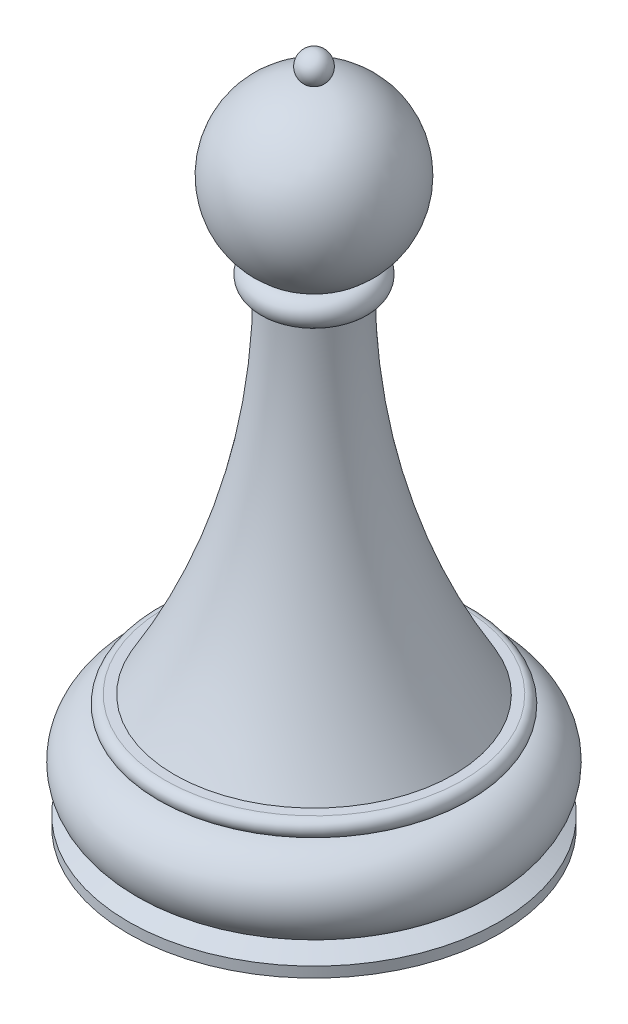
ISO-10303-21;
HEADER;
FILE_DESCRIPTION(('STEP AP214'),'2;1');
FILE_NAME('part.step','',(''),(''),'','','');
FILE_SCHEMA(('AUTOMOTIVE_DESIGN { 1 0 10303 214 1 1 1 1 }'));
ENDSEC;
DATA;
#1=APPLICATION_CONTEXT('core data for automotive mechanical design processes');
#2=APPLICATION_PROTOCOL_DEFINITION('international standard','automotive_design',2000,#1);
#3=PRODUCT_CONTEXT('',#1,'mechanical');
#4=PRODUCT('Part','Part','',(#3));
#5=PRODUCT_RELATED_PRODUCT_CATEGORY('part','',(#4));
#6=PRODUCT_DEFINITION_FORMATION('','',#4);
#7=PRODUCT_DEFINITION_CONTEXT('part definition',#1,'design');
#8=PRODUCT_DEFINITION('design','',#6,#7);
#9=PRODUCT_DEFINITION_SHAPE('','',#8);
#10=(LENGTH_UNIT() NAMED_UNIT(*) SI_UNIT(.MILLI.,.METRE.));
#11=(NAMED_UNIT(*) PLANE_ANGLE_UNIT() SI_UNIT($,.RADIAN.));
#12=(NAMED_UNIT(*) SI_UNIT($,.STERADIAN.) SOLID_ANGLE_UNIT());
#13=UNCERTAINTY_MEASURE_WITH_UNIT(LENGTH_MEASURE(1.E-05),#10,'distance_accuracy_value','');
#14=(GEOMETRIC_REPRESENTATION_CONTEXT(3) GLOBAL_UNCERTAINTY_ASSIGNED_CONTEXT((#13)) GLOBAL_UNIT_ASSIGNED_CONTEXT((#10,
#11,#12)) REPRESENTATION_CONTEXT('',''));
#15=CARTESIAN_POINT('',(0.,0.,0.));
#16=DIRECTION('',(0.,0.,1.));
#17=DIRECTION('',(1.,0.,0.));
#18=AXIS2_PLACEMENT_3D('',#15,#16,#17);
#19=CARTESIAN_POINT('',(0.,37.6874124400227,0.));
#20=DIRECTION('',(0.,1.,0.));
#21=DIRECTION('',(1.,0.,0.));
#22=AXIS2_PLACEMENT_3D('',#19,#20,#21);
#23=SPHERICAL_SURFACE('',#22,7.0570203157);
#24=CARTESIAN_POINT('',(0.,44.6975886878202,0.));
#25=DIRECTION('',(0.,1.,0.));
#26=DIRECTION('',(0.,0.,1.));
#27=AXIS2_PLACEMENT_3D('',#24,#25,#26);
#28=CIRCLE('',#27,0.81176641407367);
#29=CARTESIAN_POINT('',(0.,44.6975886878202,0.81176641407367));
#30=VERTEX_POINT('',#29);
#31=EDGE_CURVE('E11',#30,#30,#28,.T.);
#32=ORIENTED_EDGE('',*,*,#31,.F.);
#33=EDGE_LOOP('',(#32));
#34=FACE_BOUND('',#33,.T.);
#35=ADVANCED_FACE('F41',(#34),#23,.F.);
#36=CARTESIAN_POINT('',(0.,45.5983710967676,0.));
#37=DIRECTION('',(0.,1.,0.));
#38=DIRECTION('',(1.,0.,0.));
#39=AXIS2_PLACEMENT_3D('',#36,#37,#38);
#40=SPHERICAL_SURFACE('',#39,1.21258965);
#41=ORIENTED_EDGE('',*,*,#31,.T.);
#42=EDGE_LOOP('',(#41));
#43=FACE_BOUND('',#42,.T.);
#44=ADVANCED_FACE('F48',(#43),#40,.T.);
#45=CLOSED_SHELL('',(#35,#44));
#46=MANIFOLD_SOLID_BREP('B2',#45);
#47=CARTESIAN_POINT('',(0.,45.5983710967676,0.));
#48=DIRECTION('',(0.,1.,0.));
#49=DIRECTION('',(1.,0.,0.));
#50=AXIS2_PLACEMENT_3D('',#47,#48,#49);
#51=SPHERICAL_SURFACE('',#50,1.21258965);
#52=CARTESIAN_POINT('',(0.,44.6975886878202,0.));
#53=DIRECTION('',(0.,1.,0.));
#54=DIRECTION('',(0.,0.,1.));
#55=AXIS2_PLACEMENT_3D('',#52,#53,#54);
#56=CIRCLE('',#55,0.81176641407367);
#57=CARTESIAN_POINT('',(0.,44.6975886878202,0.81176641407367));
#58=VERTEX_POINT('',#57);
#59=EDGE_CURVE('E107',#58,#58,#56,.T.);
#60=ORIENTED_EDGE('',*,*,#59,.T.);
#61=EDGE_LOOP('',(#60));
#62=FACE_BOUND('',#61,.T.);
#63=ADVANCED_FACE('F67',(#62),#51,.F.);
#64=CARTESIAN_POINT('',(0.,-9.62189923178285,0.));
#65=DIRECTION('',(0.,1.,0.));
#66=DIRECTION('',(0.,0.,1.));
#67=AXIS2_PLACEMENT_3D('',#64,#65,#66);
#68=PLANE('',#67);
#69=CARTESIAN_POINT('',(0.,-9.62189923178285,0.));
#70=DIRECTION('',(0.,1.,0.));
#71=DIRECTION('',(0.,0.,1.));
#72=AXIS2_PLACEMENT_3D('',#69,#70,#71);
#73=CIRCLE('',#72,15.5626838299203);
#74=CARTESIAN_POINT('',(0.,-9.62189923178285,15.5626838299203));
#75=VERTEX_POINT('',#74);
#76=EDGE_CURVE('E40',#75,#75,#73,.T.);
#77=ORIENTED_EDGE('',*,*,#76,.F.);
#78=EDGE_LOOP('',(#77));
#79=FACE_BOUND('',#78,.T.);
#80=ADVANCED_FACE('F130',(#79),#68,.F.);
#81=CARTESIAN_POINT('',(0.,0.,0.));
#82=DIRECTION('',(0.,1.,0.));
#83=DIRECTION('',(0.,0.,1.));
#84=AXIS2_PLACEMENT_3D('',#81,#82,#83);
#85=CYLINDRICAL_SURFACE('',#84,15.5626838299203);
#86=CARTESIAN_POINT('',(0.,-8.75150019545093,0.));
#87=DIRECTION('',(0.,1.,0.));
#88=DIRECTION('',(0.,0.,1.));
#89=AXIS2_PLACEMENT_3D('',#86,#87,#88);
#90=CIRCLE('',#89,15.5626838299203);
#91=CARTESIAN_POINT('',(0.,-8.75150019545093,15.5626838299203));
#92=VERTEX_POINT('',#91);
#93=EDGE_CURVE('E73',#92,#92,#90,.T.);
#94=ORIENTED_EDGE('',*,*,#93,.F.);
#95=EDGE_LOOP('',(#94));
#96=FACE_BOUND('',#95,.T.);
#97=ORIENTED_EDGE('',*,*,#76,.T.);
#98=EDGE_LOOP('',(#97));
#99=FACE_BOUND('',#98,.T.);
#100=ADVANCED_FACE('F134',(#96,#99),#85,.T.);
#101=CARTESIAN_POINT('',(0.,-8.75150019545093,0.));
#102=DIRECTION('',(0.,-1.,0.));
#103=DIRECTION('',(0.,0.,-1.));
#104=AXIS2_PLACEMENT_3D('',#101,#102,#103);
#105=CONICAL_SURFACE('',#104,15.5626838299203,1.12819899052598);
#106=CARTESIAN_POINT('',(0.,-7.96056000410056,0.));
#107=DIRECTION('',(0.,1.,0.));
#108=DIRECTION('',(0.,0.,1.));
#109=AXIS2_PLACEMENT_3D('',#106,#107,#108);
#110=CIRCLE('',#109,13.8938837061669);
#111=CARTESIAN_POINT('',(0.,-7.96056000410056,13.8938837061669));
#112=VERTEX_POINT('',#111);
#113=EDGE_CURVE('E77',#112,#112,#110,.T.);
#114=ORIENTED_EDGE('',*,*,#113,.F.);
#115=EDGE_LOOP('',(#114));
#116=FACE_BOUND('',#115,.T.);
#117=ORIENTED_EDGE('',*,*,#93,.T.);
#118=EDGE_LOOP('',(#117));
#119=FACE_BOUND('',#118,.T.);
#120=ADVANCED_FACE('F139',(#116,#119),#105,.T.);
#121=CARTESIAN_POINT('',(0.,-4.86326513623308,0.));
#122=DIRECTION('',(0.,1.,0.));
#123=DIRECTION('',(0.,0.,1.));
#124=AXIS2_PLACEMENT_3D('',#121,#122,#123);
#125=TOROIDAL_SURFACE('',#124,12.4225559039821,3.429);
#126=CARTESIAN_POINT('',(0.,-1.43471544038389,0.));
#127=DIRECTION('',(0.,1.,0.));
#128=DIRECTION('',(0.,0.,1.));
#129=AXIS2_PLACEMENT_3D('',#126,#127,#128);
#130=CIRCLE('',#129,12.4781255278103);
#131=CARTESIAN_POINT('',(0.,-1.43471544038389,12.4781255278103));
#132=VERTEX_POINT('',#131);
#133=EDGE_CURVE('E81',#132,#132,#130,.T.);
#134=ORIENTED_EDGE('',*,*,#133,.F.);
#135=EDGE_LOOP('',(#134));
#136=FACE_BOUND('',#135,.T.);
#137=ORIENTED_EDGE('',*,*,#113,.T.);
#138=EDGE_LOOP('',(#137));
#139=FACE_BOUND('',#138,.T.);
#140=ADVANCED_FACE('F145',(#136,#139),#125,.T.);
#141=CARTESIAN_POINT('',(0.,0.,0.));
#142=DIRECTION('',(0.,1.,0.));
#143=DIRECTION('',(0.,0.,1.));
#144=AXIS2_PLACEMENT_3D('',#141,#142,#143);
#145=CYLINDRICAL_SURFACE('',#144,12.4781255278103);
#146=ORIENTED_EDGE('',*,*,#133,.T.);
#147=EDGE_LOOP('',(#146));
#148=FACE_BOUND('',#147,.T.);
#149=CARTESIAN_POINT('',(0.,-1.42836544038389,0.));
#150=DIRECTION('',(0.,1.,0.));
#151=DIRECTION('',(0.,0.,1.));
#152=AXIS2_PLACEMENT_3D('',#149,#150,#151);
#153=CIRCLE('',#152,12.4781255278103);
#154=CARTESIAN_POINT('',(0.,-1.42836544038389,12.4781255278103));
#155=VERTEX_POINT('',#154);
#156=EDGE_CURVE('E86',#155,#155,#153,.T.);
#157=ORIENTED_EDGE('',*,*,#156,.F.);
#158=EDGE_LOOP('',(#157));
#159=FACE_BOUND('',#158,.T.);
#160=ADVANCED_FACE('F149',(#148,#159),#145,.T.);
#161=CARTESIAN_POINT('',(0.,-0.714375,0.));
#162=DIRECTION('',(0.,1.,0.));
#163=DIRECTION('',(0.,0.,1.));
#164=AXIS2_PLACEMENT_3D('',#161,#162,#163);
#165=TOROIDAL_SURFACE('',#164,12.5015625,0.714375);
#166=ORIENTED_EDGE('',*,*,#156,.T.);
#167=EDGE_LOOP('',(#166));
#168=FACE_BOUND('',#167,.T.);
#169=CARTESIAN_POINT('',(0.,0.,0.));
#170=DIRECTION('',(0.,1.,0.));
#171=DIRECTION('',(0.,0.,1.));
#172=AXIS2_PLACEMENT_3D('',#169,#170,#171);
#173=CIRCLE('',#172,12.5015625);
#174=CARTESIAN_POINT('',(0.,0.,12.5015625));
#175=VERTEX_POINT('',#174);
#176=EDGE_CURVE('E89',#175,#175,#173,.T.);
#177=ORIENTED_EDGE('',*,*,#176,.F.);
#178=EDGE_LOOP('',(#177));
#179=FACE_BOUND('',#178,.T.);
#180=ADVANCED_FACE('F153',(#168,#179),#165,.T.);
#181=CARTESIAN_POINT('',(0.,0.,0.));
#182=DIRECTION('',(0.,1.,0.));
#183=DIRECTION('',(0.,0.,1.));
#184=AXIS2_PLACEMENT_3D('',#181,#182,#183);
#185=PLANE('',#184);
#186=ORIENTED_EDGE('',*,*,#176,.T.);
#187=EDGE_LOOP('',(#186));
#188=FACE_BOUND('',#187,.T.);
#189=CARTESIAN_POINT('',(0.,0.,0.));
#190=DIRECTION('',(0.,1.,0.));
#191=DIRECTION('',(0.,0.,1.));
#192=AXIS2_PLACEMENT_3D('',#189,#190,#191);
#193=CIRCLE('',#192,11.705326418208);
#194=CARTESIAN_POINT('',(0.,0.,11.705326418208));
#195=VERTEX_POINT('',#194);
#196=EDGE_CURVE('E92',#195,#195,#193,.T.);
#197=ORIENTED_EDGE('',*,*,#196,.F.);
#198=EDGE_LOOP('',(#197));
#199=FACE_BOUND('',#198,.T.);
#200=ADVANCED_FACE('F157',(#188,#199),#185,.T.);
#201=CARTESIAN_POINT('',(0.,29.356717947456,0.));
#202=DIRECTION('',(0.,1.,0.));
#203=DIRECTION('',(0.,0.,1.));
#204=AXIS2_PLACEMENT_3D('',#201,#202,#203);
#205=TOROIDAL_SURFACE('',#204,61.0646059881854,57.429568763083);
#206=ORIENTED_EDGE('',*,*,#196,.T.);
#207=EDGE_LOOP('',(#206));
#208=FACE_BOUND('',#207,.T.);
#209=CARTESIAN_POINT('',(0.,29.3567179474556,0.));
#210=DIRECTION('',(0.,1.,0.));
#211=DIRECTION('',(0.,0.,1.));
#212=AXIS2_PLACEMENT_3D('',#209,#210,#211);
#213=CIRCLE('',#212,3.63503722510249);
#214=CARTESIAN_POINT('',(0.,29.3567179474556,3.63503722510249));
#215=VERTEX_POINT('',#214);
#216=EDGE_CURVE('E95',#215,#215,#213,.T.);
#217=ORIENTED_EDGE('',*,*,#216,.F.);
#218=EDGE_LOOP('',(#217));
#219=FACE_BOUND('',#218,.T.);
#220=ADVANCED_FACE('F161',(#208,#219),#205,.F.);
#221=CARTESIAN_POINT('',(2.42924126168244E-11,29.3567179474558,0.));
#222=DIRECTION('',(0.,1.,0.));
#223=DIRECTION('',(0.,0.,1.));
#224=AXIS2_PLACEMENT_3D('',#221,#222,#223);
#225=PLANE('',#224);
#226=ORIENTED_EDGE('',*,*,#216,.T.);
#227=EDGE_LOOP('',(#226));
#228=FACE_BOUND('',#227,.T.);
#229=CARTESIAN_POINT('',(0.,29.356717947456,0.));
#230=DIRECTION('',(0.,1.,0.));
#231=DIRECTION('',(0.,0.,1.));
#232=AXIS2_PLACEMENT_3D('',#229,#230,#231);
#233=CIRCLE('',#232,3.13610211775691);
#234=CARTESIAN_POINT('',(0.,29.356717947456,3.13610211775691));
#235=VERTEX_POINT('',#234);
#236=EDGE_CURVE('E98',#235,#235,#233,.T.);
#237=ORIENTED_EDGE('',*,*,#236,.F.);
#238=EDGE_LOOP('',(#237));
#239=FACE_BOUND('',#238,.T.);
#240=ADVANCED_FACE('F126',(#228,#239),#225,.T.);
#241=CARTESIAN_POINT('',(0.,0.,0.));
#242=DIRECTION('',(0.,1.,0.));
#243=DIRECTION('',(0.,0.,1.));
#244=AXIS2_PLACEMENT_3D('',#241,#242,#243);
#245=CYLINDRICAL_SURFACE('',#244,3.13610211775691);
#246=ORIENTED_EDGE('',*,*,#236,.T.);
#247=EDGE_LOOP('',(#246));
#248=FACE_BOUND('',#247,.T.);
#249=CARTESIAN_POINT('',(0.,29.5029545123464,0.));
#250=DIRECTION('',(0.,1.,0.));
#251=DIRECTION('',(0.,0.,1.));
#252=AXIS2_PLACEMENT_3D('',#249,#250,#251);
#253=CIRCLE('',#252,3.13610211775691);
#254=CARTESIAN_POINT('',(0.,29.5029545123464,3.13610211775691));
#255=VERTEX_POINT('',#254);
#256=EDGE_CURVE('E101',#255,#255,#253,.T.);
#257=ORIENTED_EDGE('',*,*,#256,.F.);
#258=EDGE_LOOP('',(#257));
#259=FACE_BOUND('',#258,.T.);
#260=ADVANCED_FACE('F120',(#248,#259),#245,.T.);
#261=CARTESIAN_POINT('',(0.,30.5120466436569,0.));
#262=DIRECTION('',(0.,1.,0.));
#263=DIRECTION('',(0.,0.,1.));
#264=AXIS2_PLACEMENT_3D('',#261,#262,#263);
#265=TOROIDAL_SURFACE('',#264,3.62963183094638,1.12331585374443);
#266=ORIENTED_EDGE('',*,*,#256,.T.);
#267=EDGE_LOOP('',(#266));
#268=FACE_BOUND('',#267,.T.);
#269=CARTESIAN_POINT('',(0.,31.6353624974013,0.));
#270=DIRECTION('',(0.,1.,0.));
#271=DIRECTION('',(0.,0.,1.));
#272=AXIS2_PLACEMENT_3D('',#269,#270,#271);
#273=CIRCLE('',#272,3.62963183094637);
#274=CARTESIAN_POINT('',(0.,31.6353624974013,3.62963183094637));
#275=VERTEX_POINT('',#274);
#276=EDGE_CURVE('E104',#275,#275,#273,.T.);
#277=ORIENTED_EDGE('',*,*,#276,.F.);
#278=EDGE_LOOP('',(#277));
#279=FACE_BOUND('',#278,.T.);
#280=ADVANCED_FACE('F115',(#268,#279),#265,.T.);
#281=CARTESIAN_POINT('',(0.,37.6874124400227,0.));
#282=DIRECTION('',(0.,1.,0.));
#283=DIRECTION('',(1.,0.,0.));
#284=AXIS2_PLACEMENT_3D('',#281,#282,#283);
#285=SPHERICAL_SURFACE('',#284,7.0570203157);
#286=ORIENTED_EDGE('',*,*,#59,.F.);
#287=EDGE_LOOP('',(#286));
#288=FACE_BOUND('',#287,.T.);
#289=ORIENTED_EDGE('',*,*,#276,.T.);
#290=EDGE_LOOP('',(#289));
#291=FACE_BOUND('',#290,.T.);
#292=ADVANCED_FACE('F112',(#288,#291),#285,.T.);
#293=CLOSED_SHELL('',(#63,#80,#100,#120,#140,#160,#180,#200,#220,#240,#260,#280,#292));
#294=MANIFOLD_SOLID_BREP('B6',#293);
#295=ADVANCED_BREP_SHAPE_REPRESENTATION('',(#18,#46,#294),#14);
#296=SHAPE_DEFINITION_REPRESENTATION(#9,#295);
ENDSEC;
END-ISO-10303-21;
